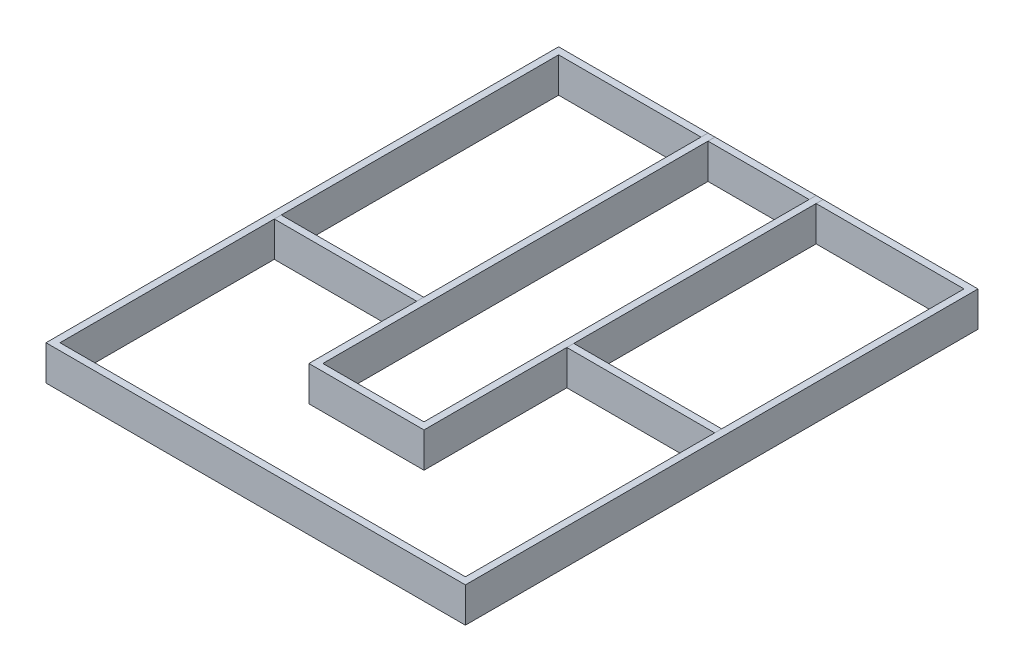
ISO-10303-21;
HEADER;
FILE_DESCRIPTION(('STEP AP214'),'2;1');
FILE_NAME('part.step','',(''),(''),'','','');
FILE_SCHEMA(('AUTOMOTIVE_DESIGN { 1 0 10303 214 1 1 1 1 }'));
ENDSEC;
DATA;
#1=APPLICATION_CONTEXT('core data for automotive mechanical design processes');
#2=APPLICATION_PROTOCOL_DEFINITION('international standard','automotive_design',2000,#1);
#3=PRODUCT_CONTEXT('',#1,'mechanical');
#4=PRODUCT('Part','Part','',(#3));
#5=PRODUCT_RELATED_PRODUCT_CATEGORY('part','',(#4));
#6=PRODUCT_DEFINITION_FORMATION('','',#4);
#7=PRODUCT_DEFINITION_CONTEXT('part definition',#1,'design');
#8=PRODUCT_DEFINITION('design','',#6,#7);
#9=PRODUCT_DEFINITION_SHAPE('','',#8);
#10=(LENGTH_UNIT() NAMED_UNIT(*) SI_UNIT(.MILLI.,.METRE.));
#11=(NAMED_UNIT(*) PLANE_ANGLE_UNIT() SI_UNIT($,.RADIAN.));
#12=(NAMED_UNIT(*) SI_UNIT($,.STERADIAN.) SOLID_ANGLE_UNIT());
#13=UNCERTAINTY_MEASURE_WITH_UNIT(LENGTH_MEASURE(1.E-05),#10,'distance_accuracy_value','');
#14=(GEOMETRIC_REPRESENTATION_CONTEXT(3) GLOBAL_UNCERTAINTY_ASSIGNED_CONTEXT((#13)) GLOBAL_UNIT_ASSIGNED_CONTEXT((#10,
#11,#12)) REPRESENTATION_CONTEXT('',''));
#15=CARTESIAN_POINT('',(0.,0.,0.));
#16=DIRECTION('',(0.,0.,1.));
#17=DIRECTION('',(1.,0.,0.));
#18=AXIS2_PLACEMENT_3D('',#15,#16,#17);
#19=CARTESIAN_POINT('',(0.,15.,0.));
#20=DIRECTION('',(0.,1.,0.));
#21=DIRECTION('',(0.,0.,1.));
#22=AXIS2_PLACEMENT_3D('',#19,#20,#21);
#23=PLANE('',#22);
#24=DIRECTION('',(0.,0.,-1.));
#25=VECTOR('',#24,1.);
#26=CARTESIAN_POINT('',(90.,15.,-110.));
#27=LINE('',#26,#25);
#28=CARTESIAN_POINT('',(90.,15.,110.));
#29=VERTEX_POINT('',#28);
#30=CARTESIAN_POINT('',(90.,15.,-110.));
#31=VERTEX_POINT('',#30);
#32=EDGE_CURVE('E242',#29,#31,#27,.T.);
#33=ORIENTED_EDGE('',*,*,#32,.T.);
#34=DIRECTION('',(-1.,0.,0.));
#35=VECTOR('',#34,1.);
#36=CARTESIAN_POINT('',(-90.,15.,-110.));
#37=LINE('',#36,#35);
#38=CARTESIAN_POINT('',(-90.,15.,-110.));
#39=VERTEX_POINT('',#38);
#40=EDGE_CURVE('E245',#31,#39,#37,.T.);
#41=ORIENTED_EDGE('',*,*,#40,.T.);
#42=DIRECTION('',(0.,0.,1.));
#43=VECTOR('',#42,1.);
#44=CARTESIAN_POINT('',(-90.,15.,-110.));
#45=LINE('',#44,#43);
#46=CARTESIAN_POINT('',(-90.,15.,110.));
#47=VERTEX_POINT('',#46);
#48=EDGE_CURVE('E248',#39,#47,#45,.T.);
#49=ORIENTED_EDGE('',*,*,#48,.T.);
#50=DIRECTION('',(1.,0.,0.));
#51=VECTOR('',#50,1.);
#52=CARTESIAN_POINT('',(-90.,15.,110.));
#53=LINE('',#52,#51);
#54=EDGE_CURVE('E250',#47,#29,#53,.T.);
#55=ORIENTED_EDGE('',*,*,#54,.T.);
#56=EDGE_LOOP('',(#33,#41,#49,#55));
#57=FACE_BOUND('',#56,.T.);
#58=DIRECTION('',(-1.,0.,0.));
#59=VECTOR('',#58,1.);
#60=CARTESIAN_POINT('',(-90.,15.,-107.));
#61=LINE('',#60,#59);
#62=CARTESIAN_POINT('',(87.,15.,-107.));
#63=VERTEX_POINT('',#62);
#64=CARTESIAN_POINT('',(-87.,15.,-107.));
#65=VERTEX_POINT('',#64);
#66=EDGE_CURVE('E214',#63,#65,#61,.T.);
#67=ORIENTED_EDGE('',*,*,#66,.F.);
#68=DIRECTION('',(0.,0.,-1.));
#69=VECTOR('',#68,1.);
#70=CARTESIAN_POINT('',(87.,15.,-110.));
#71=LINE('',#70,#69);
#72=CARTESIAN_POINT('',(87.,15.,107.));
#73=VERTEX_POINT('',#72);
#74=EDGE_CURVE('E206',#73,#63,#71,.T.);
#75=ORIENTED_EDGE('',*,*,#74,.F.);
#76=DIRECTION('',(1.,0.,0.));
#77=VECTOR('',#76,1.);
#78=CARTESIAN_POINT('',(-90.,15.,107.));
#79=LINE('',#78,#77);
#80=CARTESIAN_POINT('',(-87.,15.,107.));
#81=VERTEX_POINT('',#80);
#82=EDGE_CURVE('E228',#81,#73,#79,.T.);
#83=ORIENTED_EDGE('',*,*,#82,.F.);
#84=DIRECTION('',(0.,0.,1.));
#85=VECTOR('',#84,1.);
#86=CARTESIAN_POINT('',(-87.,15.,-110.));
#87=LINE('',#86,#85);
#88=EDGE_CURVE('E226',#65,#81,#87,.T.);
#89=ORIENTED_EDGE('',*,*,#88,.F.);
#90=EDGE_LOOP('',(#67,#75,#83,#89));
#91=FACE_BOUND('',#90,.T.);
#92=ADVANCED_FACE('F141',(#57,#91),#23,.T.);
#93=CARTESIAN_POINT('',(0.,0.,0.));
#94=DIRECTION('',(0.,1.,0.));
#95=DIRECTION('',(0.,0.,1.));
#96=AXIS2_PLACEMENT_3D('',#93,#94,#95);
#97=PLANE('',#96);
#98=DIRECTION('',(0.,0.,-1.));
#99=VECTOR('',#98,1.);
#100=CARTESIAN_POINT('',(90.,0.,-110.));
#101=LINE('',#100,#99);
#102=CARTESIAN_POINT('',(90.,0.,110.));
#103=VERTEX_POINT('',#102);
#104=CARTESIAN_POINT('',(90.,0.,-110.));
#105=VERTEX_POINT('',#104);
#106=EDGE_CURVE('E222',#103,#105,#101,.T.);
#107=ORIENTED_EDGE('',*,*,#106,.F.);
#108=DIRECTION('',(1.,0.,0.));
#109=VECTOR('',#108,1.);
#110=CARTESIAN_POINT('',(-90.,0.,110.));
#111=LINE('',#110,#109);
#112=CARTESIAN_POINT('',(-90.,0.,110.));
#113=VERTEX_POINT('',#112);
#114=EDGE_CURVE('E246',#113,#103,#111,.T.);
#115=ORIENTED_EDGE('',*,*,#114,.F.);
#116=DIRECTION('',(0.,0.,1.));
#117=VECTOR('',#116,1.);
#118=CARTESIAN_POINT('',(-90.,0.,-110.));
#119=LINE('',#118,#117);
#120=CARTESIAN_POINT('',(-90.,0.,-110.));
#121=VERTEX_POINT('',#120);
#122=EDGE_CURVE('E257',#121,#113,#119,.T.);
#123=ORIENTED_EDGE('',*,*,#122,.F.);
#124=DIRECTION('',(-1.,0.,0.));
#125=VECTOR('',#124,1.);
#126=CARTESIAN_POINT('',(-90.,0.,-110.));
#127=LINE('',#126,#125);
#128=EDGE_CURVE('E255',#105,#121,#127,.T.);
#129=ORIENTED_EDGE('',*,*,#128,.F.);
#130=EDGE_LOOP('',(#107,#115,#123,#129));
#131=FACE_BOUND('',#130,.T.);
#132=DIRECTION('',(0.,0.,-1.));
#133=VECTOR('',#132,1.);
#134=CARTESIAN_POINT('',(87.,0.,-110.));
#135=LINE('',#134,#133);
#136=CARTESIAN_POINT('',(87.,0.,107.));
#137=VERTEX_POINT('',#136);
#138=CARTESIAN_POINT('',(87.,0.,-107.));
#139=VERTEX_POINT('',#138);
#140=EDGE_CURVE('E164',#137,#139,#135,.T.);
#141=ORIENTED_EDGE('',*,*,#140,.T.);
#142=DIRECTION('',(-1.,0.,0.));
#143=VECTOR('',#142,1.);
#144=CARTESIAN_POINT('',(-90.,0.,-107.));
#145=LINE('',#144,#143);
#146=CARTESIAN_POINT('',(-87.,0.,-107.));
#147=VERTEX_POINT('',#146);
#148=EDGE_CURVE('E221',#139,#147,#145,.T.);
#149=ORIENTED_EDGE('',*,*,#148,.T.);
#150=DIRECTION('',(0.,0.,1.));
#151=VECTOR('',#150,1.);
#152=CARTESIAN_POINT('',(-87.,0.,-110.));
#153=LINE('',#152,#151);
#154=CARTESIAN_POINT('',(-87.,0.,107.));
#155=VERTEX_POINT('',#154);
#156=EDGE_CURVE('E234',#147,#155,#153,.T.);
#157=ORIENTED_EDGE('',*,*,#156,.T.);
#158=DIRECTION('',(1.,0.,0.));
#159=VECTOR('',#158,1.);
#160=CARTESIAN_POINT('',(-90.,0.,107.));
#161=LINE('',#160,#159);
#162=EDGE_CURVE('E215',#155,#137,#161,.T.);
#163=ORIENTED_EDGE('',*,*,#162,.T.);
#164=EDGE_LOOP('',(#141,#149,#157,#163));
#165=FACE_BOUND('',#164,.T.);
#166=ADVANCED_FACE('F275',(#131,#165),#97,.F.);
#167=CARTESIAN_POINT('',(90.,15.,-110.));
#168=DIRECTION('',(-1.,0.,0.));
#169=DIRECTION('',(0.,0.,1.));
#170=AXIS2_PLACEMENT_3D('',#167,#168,#169);
#171=PLANE('',#170);
#172=ORIENTED_EDGE('',*,*,#106,.T.);
#173=DIRECTION('',(0.,-1.,0.));
#174=VECTOR('',#173,1.);
#175=CARTESIAN_POINT('',(90.,15.,-110.));
#176=LINE('',#175,#174);
#177=EDGE_CURVE('E13',#31,#105,#176,.T.);
#178=ORIENTED_EDGE('',*,*,#177,.F.);
#179=ORIENTED_EDGE('',*,*,#32,.F.);
#180=DIRECTION('',(0.,-1.,0.));
#181=VECTOR('',#180,1.);
#182=CARTESIAN_POINT('',(90.,15.,110.));
#183=LINE('',#182,#181);
#184=EDGE_CURVE('E252',#29,#103,#183,.T.);
#185=ORIENTED_EDGE('',*,*,#184,.T.);
#186=EDGE_LOOP('',(#172,#178,#179,#185));
#187=FACE_BOUND('',#186,.T.);
#188=ADVANCED_FACE('F143',(#187),#171,.F.);
#189=CARTESIAN_POINT('',(-90.,15.,-110.));
#190=DIRECTION('',(0.,0.,1.));
#191=DIRECTION('',(1.,0.,0.));
#192=AXIS2_PLACEMENT_3D('',#189,#190,#191);
#193=PLANE('',#192);
#194=ORIENTED_EDGE('',*,*,#128,.T.);
#195=DIRECTION('',(0.,-1.,0.));
#196=VECTOR('',#195,1.);
#197=CARTESIAN_POINT('',(-90.,15.,-110.));
#198=LINE('',#197,#196);
#199=EDGE_CURVE('E149',#39,#121,#198,.T.);
#200=ORIENTED_EDGE('',*,*,#199,.F.);
#201=ORIENTED_EDGE('',*,*,#40,.F.);
#202=ORIENTED_EDGE('',*,*,#177,.T.);
#203=EDGE_LOOP('',(#194,#200,#201,#202));
#204=FACE_BOUND('',#203,.T.);
#205=ADVANCED_FACE('F285',(#204),#193,.F.);
#206=CARTESIAN_POINT('',(-90.,15.,-110.));
#207=DIRECTION('',(1.,0.,0.));
#208=DIRECTION('',(0.,0.,-1.));
#209=AXIS2_PLACEMENT_3D('',#206,#207,#208);
#210=PLANE('',#209);
#211=ORIENTED_EDGE('',*,*,#122,.T.);
#212=DIRECTION('',(0.,-1.,0.));
#213=VECTOR('',#212,1.);
#214=CARTESIAN_POINT('',(-90.,15.,110.));
#215=LINE('',#214,#213);
#216=EDGE_CURVE('E262',#47,#113,#215,.T.);
#217=ORIENTED_EDGE('',*,*,#216,.F.);
#218=ORIENTED_EDGE('',*,*,#48,.F.);
#219=ORIENTED_EDGE('',*,*,#199,.T.);
#220=EDGE_LOOP('',(#211,#217,#218,#219));
#221=FACE_BOUND('',#220,.T.);
#222=ADVANCED_FACE('F269',(#221),#210,.F.);
#223=CARTESIAN_POINT('',(-90.,15.,110.));
#224=DIRECTION('',(0.,0.,-1.));
#225=DIRECTION('',(-1.,0.,0.));
#226=AXIS2_PLACEMENT_3D('',#223,#224,#225);
#227=PLANE('',#226);
#228=ORIENTED_EDGE('',*,*,#114,.T.);
#229=ORIENTED_EDGE('',*,*,#184,.F.);
#230=ORIENTED_EDGE('',*,*,#54,.F.);
#231=ORIENTED_EDGE('',*,*,#216,.T.);
#232=EDGE_LOOP('',(#228,#229,#230,#231));
#233=FACE_BOUND('',#232,.T.);
#234=ADVANCED_FACE('F279',(#233),#227,.F.);
#235=CARTESIAN_POINT('',(87.,15.,-110.));
#236=DIRECTION('',(-1.,0.,0.));
#237=DIRECTION('',(0.,0.,1.));
#238=AXIS2_PLACEMENT_3D('',#235,#236,#237);
#239=PLANE('',#238);
#240=ORIENTED_EDGE('',*,*,#140,.F.);
#241=DIRECTION('',(0.,-1.,0.));
#242=VECTOR('',#241,1.);
#243=CARTESIAN_POINT('',(87.,15.,107.));
#244=LINE('',#243,#242);
#245=EDGE_CURVE('E210',#73,#137,#244,.T.);
#246=ORIENTED_EDGE('',*,*,#245,.F.);
#247=ORIENTED_EDGE('',*,*,#74,.T.);
#248=DIRECTION('',(0.,-1.,0.));
#249=VECTOR('',#248,1.);
#250=CARTESIAN_POINT('',(87.,15.,-107.));
#251=LINE('',#250,#249);
#252=EDGE_CURVE('E209',#63,#139,#251,.T.);
#253=ORIENTED_EDGE('',*,*,#252,.T.);
#254=EDGE_LOOP('',(#240,#246,#247,#253));
#255=FACE_BOUND('',#254,.T.);
#256=ADVANCED_FACE('F208',(#255),#239,.T.);
#257=CARTESIAN_POINT('',(-90.,15.,-107.));
#258=DIRECTION('',(0.,0.,1.));
#259=DIRECTION('',(1.,0.,0.));
#260=AXIS2_PLACEMENT_3D('',#257,#258,#259);
#261=PLANE('',#260);
#262=ORIENTED_EDGE('',*,*,#148,.F.);
#263=ORIENTED_EDGE('',*,*,#252,.F.);
#264=ORIENTED_EDGE('',*,*,#66,.T.);
#265=DIRECTION('',(0.,-1.,0.));
#266=VECTOR('',#265,1.);
#267=CARTESIAN_POINT('',(-87.,15.,-107.));
#268=LINE('',#267,#266);
#269=EDGE_CURVE('E223',#65,#147,#268,.T.);
#270=ORIENTED_EDGE('',*,*,#269,.T.);
#271=EDGE_LOOP('',(#262,#263,#264,#270));
#272=FACE_BOUND('',#271,.T.);
#273=ADVANCED_FACE('F218',(#272),#261,.T.);
#274=CARTESIAN_POINT('',(-87.,15.,-110.));
#275=DIRECTION('',(1.,0.,0.));
#276=DIRECTION('',(0.,0.,-1.));
#277=AXIS2_PLACEMENT_3D('',#274,#275,#276);
#278=PLANE('',#277);
#279=ORIENTED_EDGE('',*,*,#156,.F.);
#280=ORIENTED_EDGE('',*,*,#269,.F.);
#281=ORIENTED_EDGE('',*,*,#88,.T.);
#282=DIRECTION('',(0.,-1.,0.));
#283=VECTOR('',#282,1.);
#284=CARTESIAN_POINT('',(-87.,15.,107.));
#285=LINE('',#284,#283);
#286=EDGE_CURVE('E156',#81,#155,#285,.T.);
#287=ORIENTED_EDGE('',*,*,#286,.T.);
#288=EDGE_LOOP('',(#279,#280,#281,#287));
#289=FACE_BOUND('',#288,.T.);
#290=ADVANCED_FACE('F308',(#289),#278,.T.);
#291=CARTESIAN_POINT('',(-90.,15.,107.));
#292=DIRECTION('',(0.,0.,-1.));
#293=DIRECTION('',(-1.,0.,0.));
#294=AXIS2_PLACEMENT_3D('',#291,#292,#293);
#295=PLANE('',#294);
#296=ORIENTED_EDGE('',*,*,#162,.F.);
#297=ORIENTED_EDGE('',*,*,#286,.F.);
#298=ORIENTED_EDGE('',*,*,#82,.T.);
#299=ORIENTED_EDGE('',*,*,#245,.T.);
#300=EDGE_LOOP('',(#296,#297,#298,#299));
#301=FACE_BOUND('',#300,.T.);
#302=ADVANCED_FACE('F312',(#301),#295,.T.);
#303=CLOSED_SHELL('',(#92,#166,#188,#205,#222,#234,#256,#273,#290,#302));
#304=MANIFOLD_SOLID_BREP('B2',#303);
#305=CARTESIAN_POINT('',(23.5234745302394,15.,0.));
#306=DIRECTION('',(0.,0.,-1.));
#307=DIRECTION('',(-1.,0.,0.));
#308=AXIS2_PLACEMENT_3D('',#305,#306,#307);
#309=PLANE('',#308);
#310=DIRECTION('',(1.,0.,0.));
#311=VECTOR('',#310,1.);
#312=CARTESIAN_POINT('',(23.5234745302394,0.,0.));
#313=LINE('',#312,#311);
#314=CARTESIAN_POINT('',(23.5234745302394,0.,0.));
#315=VERTEX_POINT('',#314);
#316=CARTESIAN_POINT('',(90.,0.,0.));
#317=VERTEX_POINT('',#316);
#318=EDGE_CURVE('E443',#315,#317,#313,.T.);
#319=ORIENTED_EDGE('',*,*,#318,.T.);
#320=DIRECTION('',(0.,-1.,0.));
#321=VECTOR('',#320,1.);
#322=CARTESIAN_POINT('',(90.,15.,0.));
#323=LINE('',#322,#321);
#324=CARTESIAN_POINT('',(90.,15.,0.));
#325=VERTEX_POINT('',#324);
#326=EDGE_CURVE('E139',#325,#317,#323,.T.);
#327=ORIENTED_EDGE('',*,*,#326,.F.);
#328=DIRECTION('',(1.,0.,0.));
#329=VECTOR('',#328,1.);
#330=CARTESIAN_POINT('',(23.5234745302394,15.,0.));
#331=LINE('',#330,#329);
#332=CARTESIAN_POINT('',(23.5234745302394,15.,0.));
#333=VERTEX_POINT('',#332);
#334=EDGE_CURVE('E420',#333,#325,#331,.T.);
#335=ORIENTED_EDGE('',*,*,#334,.F.);
#336=DIRECTION('',(0.,-1.,0.));
#337=VECTOR('',#336,1.);
#338=CARTESIAN_POINT('',(23.5234745302394,15.,0.));
#339=LINE('',#338,#337);
#340=EDGE_CURVE('E396',#333,#315,#339,.T.);
#341=ORIENTED_EDGE('',*,*,#340,.T.);
#342=EDGE_LOOP('',(#319,#327,#335,#341));
#343=FACE_BOUND('',#342,.T.);
#344=ADVANCED_FACE('F380',(#343),#309,.F.);
#345=CARTESIAN_POINT('',(90.,15.,-2.99999999999999));
#346=DIRECTION('',(1.,0.,0.));
#347=DIRECTION('',(0.,0.,-1.));
#348=AXIS2_PLACEMENT_3D('',#345,#346,#347);
#349=PLANE('',#348);
#350=DIRECTION('',(0.,0.,1.));
#351=VECTOR('',#350,1.);
#352=CARTESIAN_POINT('',(90.,0.,-2.99999999999999));
#353=LINE('',#352,#351);
#354=CARTESIAN_POINT('',(90.,0.,-2.99999999999999));
#355=VERTEX_POINT('',#354);
#356=EDGE_CURVE('E429',#355,#317,#353,.T.);
#357=ORIENTED_EDGE('',*,*,#356,.F.);
#358=DIRECTION('',(0.,-1.,0.));
#359=VECTOR('',#358,1.);
#360=CARTESIAN_POINT('',(90.,15.,-2.99999999999999));
#361=LINE('',#360,#359);
#362=CARTESIAN_POINT('',(90.,15.,-2.99999999999999));
#363=VERTEX_POINT('',#362);
#364=EDGE_CURVE('E388',#363,#355,#361,.T.);
#365=ORIENTED_EDGE('',*,*,#364,.F.);
#366=DIRECTION('',(0.,0.,1.));
#367=VECTOR('',#366,1.);
#368=CARTESIAN_POINT('',(90.,15.,-2.99999999999999));
#369=LINE('',#368,#367);
#370=EDGE_CURVE('E427',#363,#325,#369,.T.);
#371=ORIENTED_EDGE('',*,*,#370,.T.);
#372=ORIENTED_EDGE('',*,*,#326,.T.);
#373=EDGE_LOOP('',(#357,#365,#371,#372));
#374=FACE_BOUND('',#373,.T.);
#375=ADVANCED_FACE('F426',(#374),#349,.T.);
#376=CARTESIAN_POINT('',(23.5234745302394,15.,-2.99999999999999));
#377=DIRECTION('',(0.,0.,-1.));
#378=DIRECTION('',(-1.,0.,0.));
#379=AXIS2_PLACEMENT_3D('',#376,#377,#378);
#380=PLANE('',#379);
#381=DIRECTION('',(1.,0.,0.));
#382=VECTOR('',#381,1.);
#383=CARTESIAN_POINT('',(23.5234745302394,0.,-2.99999999999999));
#384=LINE('',#383,#382);
#385=CARTESIAN_POINT('',(23.5234745302394,0.,-2.99999999999999));
#386=VERTEX_POINT('',#385);
#387=EDGE_CURVE('E446',#386,#355,#384,.T.);
#388=ORIENTED_EDGE('',*,*,#387,.F.);
#389=DIRECTION('',(0.,-1.,0.));
#390=VECTOR('',#389,1.);
#391=CARTESIAN_POINT('',(23.5234745302394,15.,-2.99999999999999));
#392=LINE('',#391,#390);
#393=CARTESIAN_POINT('',(23.5234745302394,15.,-2.99999999999999));
#394=VERTEX_POINT('',#393);
#395=EDGE_CURVE('E409',#394,#386,#392,.T.);
#396=ORIENTED_EDGE('',*,*,#395,.F.);
#397=DIRECTION('',(1.,0.,0.));
#398=VECTOR('',#397,1.);
#399=CARTESIAN_POINT('',(23.5234745302394,15.,-2.99999999999999));
#400=LINE('',#399,#398);
#401=EDGE_CURVE('E435',#394,#363,#400,.T.);
#402=ORIENTED_EDGE('',*,*,#401,.T.);
#403=ORIENTED_EDGE('',*,*,#364,.T.);
#404=EDGE_LOOP('',(#388,#396,#402,#403));
#405=FACE_BOUND('',#404,.T.);
#406=ADVANCED_FACE('F437',(#405),#380,.T.);
#407=CARTESIAN_POINT('',(23.5234745302394,15.,0.));
#408=DIRECTION('',(-1.,0.,0.));
#409=DIRECTION('',(0.,0.,1.));
#410=AXIS2_PLACEMENT_3D('',#407,#408,#409);
#411=PLANE('',#410);
#412=DIRECTION('',(0.,0.,-1.));
#413=VECTOR('',#412,1.);
#414=CARTESIAN_POINT('',(23.5234745302394,0.,0.));
#415=LINE('',#414,#413);
#416=EDGE_CURVE('E448',#315,#386,#415,.T.);
#417=ORIENTED_EDGE('',*,*,#416,.F.);
#418=ORIENTED_EDGE('',*,*,#340,.F.);
#419=DIRECTION('',(0.,0.,-1.));
#420=VECTOR('',#419,1.);
#421=CARTESIAN_POINT('',(23.5234745302394,15.,0.));
#422=LINE('',#421,#420);
#423=EDGE_CURVE('E438',#333,#394,#422,.T.);
#424=ORIENTED_EDGE('',*,*,#423,.T.);
#425=ORIENTED_EDGE('',*,*,#395,.T.);
#426=EDGE_LOOP('',(#417,#418,#424,#425));
#427=FACE_BOUND('',#426,.T.);
#428=ADVANCED_FACE('F454',(#427),#411,.T.);
#429=CARTESIAN_POINT('',(0.,15.,0.));
#430=DIRECTION('',(0.,-1.,0.));
#431=DIRECTION('',(-1.,0.,0.));
#432=AXIS2_PLACEMENT_3D('',#429,#430,#431);
#433=PLANE('',#432);
#434=ORIENTED_EDGE('',*,*,#334,.T.);
#435=ORIENTED_EDGE('',*,*,#370,.F.);
#436=ORIENTED_EDGE('',*,*,#401,.F.);
#437=ORIENTED_EDGE('',*,*,#423,.F.);
#438=EDGE_LOOP('',(#434,#435,#436,#437));
#439=FACE_BOUND('',#438,.T.);
#440=ADVANCED_FACE('F434',(#439),#433,.F.);
#441=CARTESIAN_POINT('',(0.,0.,0.));
#442=DIRECTION('',(0.,-1.,0.));
#443=DIRECTION('',(-1.,0.,0.));
#444=AXIS2_PLACEMENT_3D('',#441,#442,#443);
#445=PLANE('',#444);
#446=ORIENTED_EDGE('',*,*,#318,.F.);
#447=ORIENTED_EDGE('',*,*,#416,.T.);
#448=ORIENTED_EDGE('',*,*,#387,.T.);
#449=ORIENTED_EDGE('',*,*,#356,.T.);
#450=EDGE_LOOP('',(#446,#447,#448,#449));
#451=FACE_BOUND('',#450,.T.);
#452=ADVANCED_FACE('F453',(#451),#445,.T.);
#453=CLOSED_SHELL('',(#344,#375,#406,#428,#440,#452));
#454=MANIFOLD_SOLID_BREP('B7',#453);
#455=CARTESIAN_POINT('',(-90.,15.,15.0288865054308));
#456=DIRECTION('',(0.,0.,-1.));
#457=DIRECTION('',(-1.,0.,0.));
#458=AXIS2_PLACEMENT_3D('',#455,#456,#457);
#459=PLANE('',#458);
#460=DIRECTION('',(1.,0.,0.));
#461=VECTOR('',#460,1.);
#462=CARTESIAN_POINT('',(-90.,0.,15.0288865054308));
#463=LINE('',#462,#461);
#464=CARTESIAN_POINT('',(-90.,0.,15.0288865054308));
#465=VERTEX_POINT('',#464);
#466=CARTESIAN_POINT('',(-25.8758219832635,0.,15.0288865054307));
#467=VERTEX_POINT('',#466);
#468=EDGE_CURVE('E575',#465,#467,#463,.T.);
#469=ORIENTED_EDGE('',*,*,#468,.T.);
#470=DIRECTION('',(0.,-1.,0.));
#471=VECTOR('',#470,1.);
#472=CARTESIAN_POINT('',(-25.8758219832635,15.,15.0288865054307));
#473=LINE('',#472,#471);
#474=CARTESIAN_POINT('',(-25.8758219832635,15.,15.0288865054307));
#475=VERTEX_POINT('',#474);
#476=EDGE_CURVE('E378',#475,#467,#473,.T.);
#477=ORIENTED_EDGE('',*,*,#476,.F.);
#478=DIRECTION('',(1.,0.,0.));
#479=VECTOR('',#478,1.);
#480=CARTESIAN_POINT('',(-90.,15.,15.0288865054308));
#481=LINE('',#480,#479);
#482=CARTESIAN_POINT('',(-90.,15.,15.0288865054308));
#483=VERTEX_POINT('',#482);
#484=EDGE_CURVE('E552',#483,#475,#481,.T.);
#485=ORIENTED_EDGE('',*,*,#484,.F.);
#486=DIRECTION('',(0.,-1.,0.));
#487=VECTOR('',#486,1.);
#488=CARTESIAN_POINT('',(-90.,15.,15.0288865054308));
#489=LINE('',#488,#487);
#490=EDGE_CURVE('E528',#483,#465,#489,.T.);
#491=ORIENTED_EDGE('',*,*,#490,.T.);
#492=EDGE_LOOP('',(#469,#477,#485,#491));
#493=FACE_BOUND('',#492,.T.);
#494=ADVANCED_FACE('F512',(#493),#459,.F.);
#495=CARTESIAN_POINT('',(-25.8758219832634,15.,12.0288865054307));
#496=DIRECTION('',(1.,0.,0.));
#497=DIRECTION('',(0.,0.,-1.));
#498=AXIS2_PLACEMENT_3D('',#495,#496,#497);
#499=PLANE('',#498);
#500=DIRECTION('',(0.,0.,1.));
#501=VECTOR('',#500,1.);
#502=CARTESIAN_POINT('',(-25.8758219832634,0.,12.0288865054307));
#503=LINE('',#502,#501);
#504=CARTESIAN_POINT('',(-25.8758219832634,0.,12.0288865054307));
#505=VERTEX_POINT('',#504);
#506=EDGE_CURVE('E561',#505,#467,#503,.T.);
#507=ORIENTED_EDGE('',*,*,#506,.F.);
#508=DIRECTION('',(0.,-1.,0.));
#509=VECTOR('',#508,1.);
#510=CARTESIAN_POINT('',(-25.8758219832634,15.,12.0288865054307));
#511=LINE('',#510,#509);
#512=CARTESIAN_POINT('',(-25.8758219832634,15.,12.0288865054307));
#513=VERTEX_POINT('',#512);
#514=EDGE_CURVE('E520',#513,#505,#511,.T.);
#515=ORIENTED_EDGE('',*,*,#514,.F.);
#516=DIRECTION('',(0.,0.,1.));
#517=VECTOR('',#516,1.);
#518=CARTESIAN_POINT('',(-25.8758219832634,15.,12.0288865054307));
#519=LINE('',#518,#517);
#520=EDGE_CURVE('E559',#513,#475,#519,.T.);
#521=ORIENTED_EDGE('',*,*,#520,.T.);
#522=ORIENTED_EDGE('',*,*,#476,.T.);
#523=EDGE_LOOP('',(#507,#515,#521,#522));
#524=FACE_BOUND('',#523,.T.);
#525=ADVANCED_FACE('F558',(#524),#499,.T.);
#526=CARTESIAN_POINT('',(-90.,15.,12.0288865054308));
#527=DIRECTION('',(0.,0.,-1.));
#528=DIRECTION('',(-1.,0.,0.));
#529=AXIS2_PLACEMENT_3D('',#526,#527,#528);
#530=PLANE('',#529);
#531=DIRECTION('',(1.,0.,0.));
#532=VECTOR('',#531,1.);
#533=CARTESIAN_POINT('',(-90.,0.,12.0288865054308));
#534=LINE('',#533,#532);
#535=CARTESIAN_POINT('',(-90.,0.,12.0288865054308));
#536=VERTEX_POINT('',#535);
#537=EDGE_CURVE('E578',#536,#505,#534,.T.);
#538=ORIENTED_EDGE('',*,*,#537,.F.);
#539=DIRECTION('',(0.,-1.,0.));
#540=VECTOR('',#539,1.);
#541=CARTESIAN_POINT('',(-90.,15.,12.0288865054308));
#542=LINE('',#541,#540);
#543=CARTESIAN_POINT('',(-90.,15.,12.0288865054308));
#544=VERTEX_POINT('',#543);
#545=EDGE_CURVE('E541',#544,#536,#542,.T.);
#546=ORIENTED_EDGE('',*,*,#545,.F.);
#547=DIRECTION('',(1.,0.,0.));
#548=VECTOR('',#547,1.);
#549=CARTESIAN_POINT('',(-90.,15.,12.0288865054308));
#550=LINE('',#549,#548);
#551=EDGE_CURVE('E567',#544,#513,#550,.T.);
#552=ORIENTED_EDGE('',*,*,#551,.T.);
#553=ORIENTED_EDGE('',*,*,#514,.T.);
#554=EDGE_LOOP('',(#538,#546,#552,#553));
#555=FACE_BOUND('',#554,.T.);
#556=ADVANCED_FACE('F569',(#555),#530,.T.);
#557=CARTESIAN_POINT('',(-90.,15.,15.0288865054308));
#558=DIRECTION('',(-1.,0.,0.));
#559=DIRECTION('',(0.,0.,1.));
#560=AXIS2_PLACEMENT_3D('',#557,#558,#559);
#561=PLANE('',#560);
#562=DIRECTION('',(0.,0.,-1.));
#563=VECTOR('',#562,1.);
#564=CARTESIAN_POINT('',(-90.,0.,15.0288865054308));
#565=LINE('',#564,#563);
#566=EDGE_CURVE('E580',#465,#536,#565,.T.);
#567=ORIENTED_EDGE('',*,*,#566,.F.);
#568=ORIENTED_EDGE('',*,*,#490,.F.);
#569=DIRECTION('',(0.,0.,-1.));
#570=VECTOR('',#569,1.);
#571=CARTESIAN_POINT('',(-90.,15.,15.0288865054308));
#572=LINE('',#571,#570);
#573=EDGE_CURVE('E570',#483,#544,#572,.T.);
#574=ORIENTED_EDGE('',*,*,#573,.T.);
#575=ORIENTED_EDGE('',*,*,#545,.T.);
#576=EDGE_LOOP('',(#567,#568,#574,#575));
#577=FACE_BOUND('',#576,.T.);
#578=ADVANCED_FACE('F586',(#577),#561,.T.);
#579=CARTESIAN_POINT('',(0.,15.,0.));
#580=DIRECTION('',(0.,-1.,0.));
#581=DIRECTION('',(-1.,0.,0.));
#582=AXIS2_PLACEMENT_3D('',#579,#580,#581);
#583=PLANE('',#582);
#584=ORIENTED_EDGE('',*,*,#484,.T.);
#585=ORIENTED_EDGE('',*,*,#520,.F.);
#586=ORIENTED_EDGE('',*,*,#551,.F.);
#587=ORIENTED_EDGE('',*,*,#573,.F.);
#588=EDGE_LOOP('',(#584,#585,#586,#587));
#589=FACE_BOUND('',#588,.T.);
#590=ADVANCED_FACE('F566',(#589),#583,.F.);
#591=CARTESIAN_POINT('',(0.,0.,0.));
#592=DIRECTION('',(0.,-1.,0.));
#593=DIRECTION('',(-1.,0.,0.));
#594=AXIS2_PLACEMENT_3D('',#591,#592,#593);
#595=PLANE('',#594);
#596=ORIENTED_EDGE('',*,*,#468,.F.);
#597=ORIENTED_EDGE('',*,*,#566,.T.);
#598=ORIENTED_EDGE('',*,*,#537,.T.);
#599=ORIENTED_EDGE('',*,*,#506,.T.);
#600=EDGE_LOOP('',(#596,#597,#598,#599));
#601=FACE_BOUND('',#600,.T.);
#602=ADVANCED_FACE('F585',(#601),#595,.T.);
#603=CLOSED_SHELL('',(#494,#525,#556,#578,#590,#602));
#604=MANIFOLD_SOLID_BREP('B133',#603);
#605=CARTESIAN_POINT('',(23.5234745302395,15.,61.291719748235));
#606=DIRECTION('',(-1.,0.,0.));
#607=DIRECTION('',(0.,0.,1.));
#608=AXIS2_PLACEMENT_3D('',#605,#606,#607);
#609=PLANE('',#608);
#610=DIRECTION('',(0.,0.,-1.));
#611=VECTOR('',#610,1.);
#612=CARTESIAN_POINT('',(23.5234745302395,0.,61.291719748235));
#613=LINE('',#612,#611);
#614=CARTESIAN_POINT('',(23.5234745302395,0.,61.291719748235));
#615=VERTEX_POINT('',#614);
#616=CARTESIAN_POINT('',(23.5234745302394,0.,-110.));
#617=VERTEX_POINT('',#616);
#618=EDGE_CURVE('E732',#615,#617,#613,.T.);
#619=ORIENTED_EDGE('',*,*,#618,.T.);
#620=DIRECTION('',(0.,-1.,0.));
#621=VECTOR('',#620,1.);
#622=CARTESIAN_POINT('',(23.5234745302394,15.,-110.));
#623=LINE('',#622,#621);
#624=CARTESIAN_POINT('',(23.5234745302394,15.,-110.));
#625=VERTEX_POINT('',#624);
#626=EDGE_CURVE('E510',#625,#617,#623,.T.);
#627=ORIENTED_EDGE('',*,*,#626,.F.);
#628=DIRECTION('',(0.,0.,-1.));
#629=VECTOR('',#628,1.);
#630=CARTESIAN_POINT('',(23.5234745302395,15.,61.291719748235));
#631=LINE('',#630,#629);
#632=CARTESIAN_POINT('',(23.5234745302395,15.,61.291719748235));
#633=VERTEX_POINT('',#632);
#634=EDGE_CURVE('E690',#633,#625,#631,.T.);
#635=ORIENTED_EDGE('',*,*,#634,.F.);
#636=DIRECTION('',(0.,-1.,0.));
#637=VECTOR('',#636,1.);
#638=CARTESIAN_POINT('',(23.5234745302395,15.,61.291719748235));
#639=LINE('',#638,#637);
#640=EDGE_CURVE('E731',#633,#615,#639,.T.);
#641=ORIENTED_EDGE('',*,*,#640,.T.);
#642=EDGE_LOOP('',(#619,#627,#635,#641));
#643=FACE_BOUND('',#642,.T.);
#644=ADVANCED_FACE('F635',(#643),#609,.F.);
#645=CARTESIAN_POINT('',(20.5234745302394,15.,-110.));
#646=DIRECTION('',(0.,0.,-1.));
#647=DIRECTION('',(-1.,0.,0.));
#648=AXIS2_PLACEMENT_3D('',#645,#646,#647);
#649=PLANE('',#648);
#650=DIRECTION('',(1.,0.,0.));
#651=VECTOR('',#650,1.);
#652=CARTESIAN_POINT('',(20.5234745302394,0.,-110.));
#653=LINE('',#652,#651);
#654=CARTESIAN_POINT('',(20.5234745302394,0.,-110.));
#655=VERTEX_POINT('',#654);
#656=EDGE_CURVE('E735',#655,#617,#653,.T.);
#657=ORIENTED_EDGE('',*,*,#656,.F.);
#658=DIRECTION('',(0.,-1.,0.));
#659=VECTOR('',#658,1.);
#660=CARTESIAN_POINT('',(20.5234745302394,15.,-110.));
#661=LINE('',#660,#659);
#662=CARTESIAN_POINT('',(20.5234745302394,15.,-110.));
#663=VERTEX_POINT('',#662);
#664=EDGE_CURVE('E643',#663,#655,#661,.T.);
#665=ORIENTED_EDGE('',*,*,#664,.F.);
#666=DIRECTION('',(1.,0.,0.));
#667=VECTOR('',#666,1.);
#668=CARTESIAN_POINT('',(20.5234745302394,15.,-110.));
#669=LINE('',#668,#667);
#670=EDGE_CURVE('E774',#663,#625,#669,.T.);
#671=ORIENTED_EDGE('',*,*,#670,.T.);
#672=ORIENTED_EDGE('',*,*,#626,.T.);
#673=EDGE_LOOP('',(#657,#665,#671,#672));
#674=FACE_BOUND('',#673,.T.);
#675=ADVANCED_FACE('F765',(#674),#649,.T.);
#676=CARTESIAN_POINT('',(20.5234745302395,15.,61.291719748235));
#677=DIRECTION('',(-1.,0.,0.));
#678=DIRECTION('',(0.,0.,1.));
#679=AXIS2_PLACEMENT_3D('',#676,#677,#678);
#680=PLANE('',#679);
#681=DIRECTION('',(0.,0.,-1.));
#682=VECTOR('',#681,1.);
#683=CARTESIAN_POINT('',(20.5234745302395,0.,61.291719748235));
#684=LINE('',#683,#682);
#685=CARTESIAN_POINT('',(20.5234745302395,0.,58.291719748235));
#686=VERTEX_POINT('',#685);
#687=EDGE_CURVE('E738',#686,#655,#684,.T.);
#688=ORIENTED_EDGE('',*,*,#687,.F.);
#689=DIRECTION('',(0.,-1.,0.));
#690=VECTOR('',#689,1.);
#691=CARTESIAN_POINT('',(20.5234745302395,15.,58.291719748235));
#692=LINE('',#691,#690);
#693=CARTESIAN_POINT('',(20.5234745302395,15.,58.291719748235));
#694=VERTEX_POINT('',#693);
#695=EDGE_CURVE('E755',#694,#686,#692,.T.);
#696=ORIENTED_EDGE('',*,*,#695,.F.);
#697=DIRECTION('',(0.,0.,-1.));
#698=VECTOR('',#697,1.);
#699=CARTESIAN_POINT('',(20.5234745302395,15.,61.291719748235));
#700=LINE('',#699,#698);
#701=EDGE_CURVE('E762',#694,#663,#700,.T.);
#702=ORIENTED_EDGE('',*,*,#701,.T.);
#703=ORIENTED_EDGE('',*,*,#664,.T.);
#704=EDGE_LOOP('',(#688,#696,#702,#703));
#705=FACE_BOUND('',#704,.T.);
#706=ADVANCED_FACE('F760',(#705),#680,.T.);
#707=CARTESIAN_POINT('',(-25.8758219832635,15.,58.291719748235));
#708=DIRECTION('',(0.,0.,-1.));
#709=DIRECTION('',(-1.,0.,0.));
#710=AXIS2_PLACEMENT_3D('',#707,#708,#709);
#711=PLANE('',#710);
#712=DIRECTION('',(1.,0.,0.));
#713=VECTOR('',#712,1.);
#714=CARTESIAN_POINT('',(-25.8758219832635,0.,58.291719748235));
#715=LINE('',#714,#713);
#716=CARTESIAN_POINT('',(-22.8758219832635,0.,58.291719748235));
#717=VERTEX_POINT('',#716);
#718=EDGE_CURVE('E741',#717,#686,#715,.T.);
#719=ORIENTED_EDGE('',*,*,#718,.F.);
#720=DIRECTION('',(0.,-1.,0.));
#721=VECTOR('',#720,1.);
#722=CARTESIAN_POINT('',(-22.8758219832635,15.,58.291719748235));
#723=LINE('',#722,#721);
#724=CARTESIAN_POINT('',(-22.8758219832635,15.,58.291719748235));
#725=VERTEX_POINT('',#724);
#726=EDGE_CURVE('E753',#725,#717,#723,.T.);
#727=ORIENTED_EDGE('',*,*,#726,.F.);
#728=DIRECTION('',(1.,0.,0.));
#729=VECTOR('',#728,1.);
#730=CARTESIAN_POINT('',(-25.8758219832635,15.,58.291719748235));
#731=LINE('',#730,#729);
#732=EDGE_CURVE('E726',#725,#694,#731,.T.);
#733=ORIENTED_EDGE('',*,*,#732,.T.);
#734=ORIENTED_EDGE('',*,*,#695,.T.);
#735=EDGE_LOOP('',(#719,#727,#733,#734));
#736=FACE_BOUND('',#735,.T.);
#737=ADVANCED_FACE('F772',(#736),#711,.T.);
#738=CARTESIAN_POINT('',(-22.8758219832635,15.,-110.));
#739=DIRECTION('',(1.,0.,0.));
#740=DIRECTION('',(0.,0.,-1.));
#741=AXIS2_PLACEMENT_3D('',#738,#739,#740);
#742=PLANE('',#741);
#743=DIRECTION('',(0.,0.,-1.));
#744=VECTOR('',#743,1.);
#745=CARTESIAN_POINT('',(-22.8758219832635,0.,-110.));
#746=LINE('',#745,#744);
#747=CARTESIAN_POINT('',(-22.8758219832635,0.,-110.));
#748=VERTEX_POINT('',#747);
#749=EDGE_CURVE('E744',#748,#717,#746,.F.);
#750=ORIENTED_EDGE('',*,*,#749,.F.);
#751=DIRECTION('',(0.,-1.,0.));
#752=VECTOR('',#751,1.);
#753=CARTESIAN_POINT('',(-22.8758219832635,15.,-110.));
#754=LINE('',#753,#752);
#755=CARTESIAN_POINT('',(-22.8758219832635,15.,-110.));
#756=VERTEX_POINT('',#755);
#757=EDGE_CURVE('E714',#756,#748,#754,.T.);
#758=ORIENTED_EDGE('',*,*,#757,.F.);
#759=DIRECTION('',(0.,0.,-1.));
#760=VECTOR('',#759,1.);
#761=CARTESIAN_POINT('',(-22.8758219832635,15.,-110.));
#762=LINE('',#761,#760);
#763=EDGE_CURVE('E724',#756,#725,#762,.F.);
#764=ORIENTED_EDGE('',*,*,#763,.T.);
#765=ORIENTED_EDGE('',*,*,#726,.T.);
#766=EDGE_LOOP('',(#750,#758,#764,#765));
#767=FACE_BOUND('',#766,.T.);
#768=ADVANCED_FACE('F779',(#767),#742,.T.);
#769=CARTESIAN_POINT('',(-25.8758219832635,15.,-110.));
#770=DIRECTION('',(0.,0.,-1.));
#771=DIRECTION('',(-1.,0.,0.));
#772=AXIS2_PLACEMENT_3D('',#769,#770,#771);
#773=PLANE('',#772);
#774=DIRECTION('',(1.,0.,0.));
#775=VECTOR('',#774,1.);
#776=CARTESIAN_POINT('',(-25.8758219832635,0.,-110.));
#777=LINE('',#776,#775);
#778=CARTESIAN_POINT('',(-25.8758219832635,0.,-110.));
#779=VERTEX_POINT('',#778);
#780=EDGE_CURVE('E713',#779,#748,#777,.T.);
#781=ORIENTED_EDGE('',*,*,#780,.F.);
#782=DIRECTION('',(0.,-1.,0.));
#783=VECTOR('',#782,1.);
#784=CARTESIAN_POINT('',(-25.8758219832635,15.,-110.));
#785=LINE('',#784,#783);
#786=CARTESIAN_POINT('',(-25.8758219832635,15.,-110.));
#787=VERTEX_POINT('',#786);
#788=EDGE_CURVE('E707',#787,#779,#785,.T.);
#789=ORIENTED_EDGE('',*,*,#788,.F.);
#790=DIRECTION('',(1.,0.,0.));
#791=VECTOR('',#790,1.);
#792=CARTESIAN_POINT('',(-25.8758219832635,15.,-110.));
#793=LINE('',#792,#791);
#794=EDGE_CURVE('E711',#787,#756,#793,.T.);
#795=ORIENTED_EDGE('',*,*,#794,.T.);
#796=ORIENTED_EDGE('',*,*,#757,.T.);
#797=EDGE_LOOP('',(#781,#789,#795,#796));
#798=FACE_BOUND('',#797,.T.);
#799=ADVANCED_FACE('F709',(#798),#773,.T.);
#800=CARTESIAN_POINT('',(-25.8758219832635,15.,-110.));
#801=DIRECTION('',(1.,0.,0.));
#802=DIRECTION('',(0.,0.,-1.));
#803=AXIS2_PLACEMENT_3D('',#800,#801,#802);
#804=PLANE('',#803);
#805=DIRECTION('',(0.,0.,1.));
#806=VECTOR('',#805,1.);
#807=CARTESIAN_POINT('',(-25.8758219832635,0.,-110.));
#808=LINE('',#807,#806);
#809=CARTESIAN_POINT('',(-25.8758219832635,0.,61.291719748235));
#810=VERTEX_POINT('',#809);
#811=EDGE_CURVE('E678',#779,#810,#808,.T.);
#812=ORIENTED_EDGE('',*,*,#811,.T.);
#813=DIRECTION('',(0.,-1.,0.));
#814=VECTOR('',#813,1.);
#815=CARTESIAN_POINT('',(-25.8758219832635,15.,61.291719748235));
#816=LINE('',#815,#814);
#817=CARTESIAN_POINT('',(-25.8758219832635,15.,61.291719748235));
#818=VERTEX_POINT('',#817);
#819=EDGE_CURVE('E715',#818,#810,#816,.T.);
#820=ORIENTED_EDGE('',*,*,#819,.F.);
#821=DIRECTION('',(0.,0.,1.));
#822=VECTOR('',#821,1.);
#823=CARTESIAN_POINT('',(-25.8758219832635,15.,-110.));
#824=LINE('',#823,#822);
#825=EDGE_CURVE('E717',#787,#818,#824,.T.);
#826=ORIENTED_EDGE('',*,*,#825,.F.);
#827=ORIENTED_EDGE('',*,*,#788,.T.);
#828=EDGE_LOOP('',(#812,#820,#826,#827));
#829=FACE_BOUND('',#828,.T.);
#830=ADVANCED_FACE('F718',(#829),#804,.F.);
#831=CARTESIAN_POINT('',(-25.8758219832635,15.,61.291719748235));
#832=DIRECTION('',(0.,0.,-1.));
#833=DIRECTION('',(-1.,0.,0.));
#834=AXIS2_PLACEMENT_3D('',#831,#832,#833);
#835=PLANE('',#834);
#836=DIRECTION('',(1.,0.,0.));
#837=VECTOR('',#836,1.);
#838=CARTESIAN_POINT('',(-25.8758219832635,0.,61.291719748235));
#839=LINE('',#838,#837);
#840=EDGE_CURVE('E684',#810,#615,#839,.T.);
#841=ORIENTED_EDGE('',*,*,#840,.T.);
#842=ORIENTED_EDGE('',*,*,#640,.F.);
#843=DIRECTION('',(1.,0.,0.));
#844=VECTOR('',#843,1.);
#845=CARTESIAN_POINT('',(-25.8758219832635,15.,61.291719748235));
#846=LINE('',#845,#844);
#847=EDGE_CURVE('E651',#818,#633,#846,.T.);
#848=ORIENTED_EDGE('',*,*,#847,.F.);
#849=ORIENTED_EDGE('',*,*,#819,.T.);
#850=EDGE_LOOP('',(#841,#842,#848,#849));
#851=FACE_BOUND('',#850,.T.);
#852=ADVANCED_FACE('F781',(#851),#835,.F.);
#853=CARTESIAN_POINT('',(0.,15.,0.));
#854=DIRECTION('',(0.,-1.,0.));
#855=DIRECTION('',(-1.,0.,0.));
#856=AXIS2_PLACEMENT_3D('',#853,#854,#855);
#857=PLANE('',#856);
#858=ORIENTED_EDGE('',*,*,#634,.T.);
#859=ORIENTED_EDGE('',*,*,#670,.F.);
#860=ORIENTED_EDGE('',*,*,#701,.F.);
#861=ORIENTED_EDGE('',*,*,#732,.F.);
#862=ORIENTED_EDGE('',*,*,#763,.F.);
#863=ORIENTED_EDGE('',*,*,#794,.F.);
#864=ORIENTED_EDGE('',*,*,#825,.T.);
#865=ORIENTED_EDGE('',*,*,#847,.T.);
#866=EDGE_LOOP('',(#858,#859,#860,#861,#862,#863,#864,#865));
#867=FACE_BOUND('',#866,.T.);
#868=ADVANCED_FACE('F721',(#867),#857,.F.);
#869=CARTESIAN_POINT('',(0.,0.,0.));
#870=DIRECTION('',(0.,-1.,0.));
#871=DIRECTION('',(-1.,0.,0.));
#872=AXIS2_PLACEMENT_3D('',#869,#870,#871);
#873=PLANE('',#872);
#874=ORIENTED_EDGE('',*,*,#618,.F.);
#875=ORIENTED_EDGE('',*,*,#840,.F.);
#876=ORIENTED_EDGE('',*,*,#811,.F.);
#877=ORIENTED_EDGE('',*,*,#780,.T.);
#878=ORIENTED_EDGE('',*,*,#749,.T.);
#879=ORIENTED_EDGE('',*,*,#718,.T.);
#880=ORIENTED_EDGE('',*,*,#687,.T.);
#881=ORIENTED_EDGE('',*,*,#656,.T.);
#882=EDGE_LOOP('',(#874,#875,#876,#877,#878,#879,#880,#881));
#883=FACE_BOUND('',#882,.T.);
#884=ADVANCED_FACE('F768',(#883),#873,.T.);
#885=CLOSED_SHELL('',(#644,#675,#706,#737,#768,#799,#830,#852,#868,#884));
#886=MANIFOLD_SOLID_BREP('B372',#885);
#887=ADVANCED_BREP_SHAPE_REPRESENTATION('',(#18,#304,#454,#604,#886),#14);
#888=SHAPE_DEFINITION_REPRESENTATION(#9,#887);
ENDSEC;
END-ISO-10303-21;
